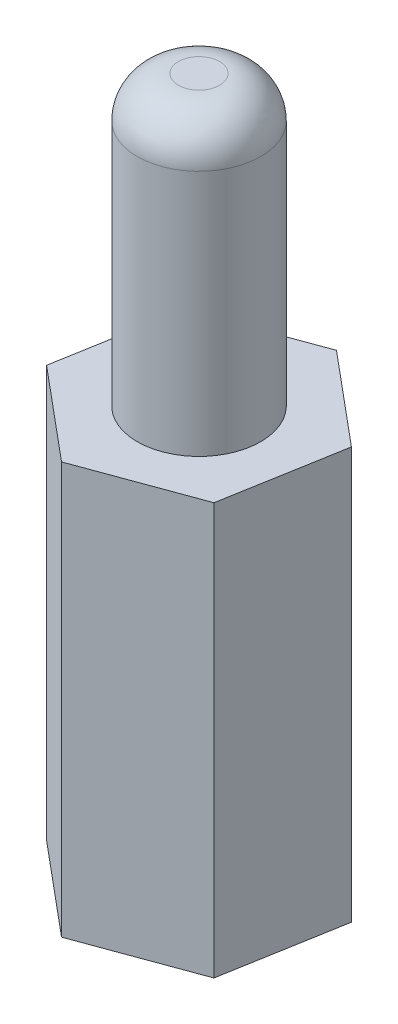
ISO-10303-21;
HEADER;
FILE_DESCRIPTION(('STEP AP214'),'2;1');
FILE_NAME('part.step','',(''),(''),'','','');
FILE_SCHEMA(('AUTOMOTIVE_DESIGN { 1 0 10303 214 1 1 1 1 }'));
ENDSEC;
DATA;
#1=APPLICATION_CONTEXT('core data for automotive mechanical design processes');
#2=APPLICATION_PROTOCOL_DEFINITION('international standard','automotive_design',2000,#1);
#3=PRODUCT_CONTEXT('',#1,'mechanical');
#4=PRODUCT('Part','Part','',(#3));
#5=PRODUCT_RELATED_PRODUCT_CATEGORY('part','',(#4));
#6=PRODUCT_DEFINITION_FORMATION('','',#4);
#7=PRODUCT_DEFINITION_CONTEXT('part definition',#1,'design');
#8=PRODUCT_DEFINITION('design','',#6,#7);
#9=PRODUCT_DEFINITION_SHAPE('','',#8);
#10=(LENGTH_UNIT() NAMED_UNIT(*) SI_UNIT(.MILLI.,.METRE.));
#11=(NAMED_UNIT(*) PLANE_ANGLE_UNIT() SI_UNIT($,.RADIAN.));
#12=(NAMED_UNIT(*) SI_UNIT($,.STERADIAN.) SOLID_ANGLE_UNIT());
#13=UNCERTAINTY_MEASURE_WITH_UNIT(LENGTH_MEASURE(1.E-05),#10,'distance_accuracy_value','');
#14=(GEOMETRIC_REPRESENTATION_CONTEXT(3) GLOBAL_UNCERTAINTY_ASSIGNED_CONTEXT((#13)) GLOBAL_UNIT_ASSIGNED_CONTEXT((#10,
#11,#12)) REPRESENTATION_CONTEXT('',''));
#15=CARTESIAN_POINT('',(0.,0.,0.));
#16=DIRECTION('',(0.,0.,1.));
#17=DIRECTION('',(1.,0.,0.));
#18=AXIS2_PLACEMENT_3D('',#15,#16,#17);
#19=CARTESIAN_POINT('',(-0.495994709202007,10.,2.84382182665809));
#20=DIRECTION('',(-0.343765976383913,0.,-0.939055351659749));
#21=DIRECTION('',(-0.939055351659749,0.,0.343765976383913));
#22=AXIS2_PLACEMENT_3D('',#19,#20,#21);
#23=PLANE('',#22);
#24=DIRECTION('',(0.939055351659749,0.,-0.343765976383913));
#25=VECTOR('',#24,1.);
#26=CARTESIAN_POINT('',(-0.495994709202007,0.,2.84382182665809));
#27=LINE('',#26,#25);
#28=CARTESIAN_POINT('',(-0.495994709202007,0.,2.84382182665809));
#29=VERTEX_POINT('',#28);
#30=CARTESIAN_POINT('',(2.21482459112157,0.,1.85145493164066));
#31=VERTEX_POINT('',#30);
#32=EDGE_CURVE('E134',#29,#31,#27,.T.);
#33=ORIENTED_EDGE('',*,*,#32,.T.);
#34=DIRECTION('',(0.,-1.,0.));
#35=VECTOR('',#34,1.);
#36=CARTESIAN_POINT('',(2.21482459112157,10.,1.85145493164066));
#37=LINE('',#36,#35);
#38=CARTESIAN_POINT('',(2.21482459112157,10.,1.85145493164066));
#39=VERTEX_POINT('',#38);
#40=EDGE_CURVE('E162',#39,#31,#37,.T.);
#41=ORIENTED_EDGE('',*,*,#40,.F.);
#42=DIRECTION('',(0.939055351659749,0.,-0.343765976383913));
#43=VECTOR('',#42,1.);
#44=CARTESIAN_POINT('',(-0.495994709202007,10.,2.84382182665809));
#45=LINE('',#44,#43);
#46=CARTESIAN_POINT('',(-0.495994709202007,10.,2.84382182665809));
#47=VERTEX_POINT('',#46);
#48=EDGE_CURVE('E151',#47,#39,#45,.T.);
#49=ORIENTED_EDGE('',*,*,#48,.F.);
#50=DIRECTION('',(0.,-1.,0.));
#51=VECTOR('',#50,1.);
#52=CARTESIAN_POINT('',(-0.495994709202007,10.,2.84382182665809));
#53=LINE('',#52,#51);
#54=EDGE_CURVE('E130',#47,#29,#53,.T.);
#55=ORIENTED_EDGE('',*,*,#54,.T.);
#56=EDGE_LOOP('',(#33,#41,#49,#55));
#57=FACE_BOUND('',#56,.T.);
#58=ADVANCED_FACE('F43',(#57),#23,.F.);
#59=CARTESIAN_POINT('',(2.21482459112157,10.,1.85145493164066));
#60=DIRECTION('',(-0.985128778289029,0.,-0.171817607324645));
#61=DIRECTION('',(-0.171817607324645,0.,0.985128778289029));
#62=AXIS2_PLACEMENT_3D('',#59,#60,#61);
#63=PLANE('',#62);
#64=DIRECTION('',(0.171817607324645,0.,-0.985128778289029));
#65=VECTOR('',#64,1.);
#66=CARTESIAN_POINT('',(2.21482459112157,0.,1.85145493164066));
#67=LINE('',#66,#65);
#68=CARTESIAN_POINT('',(2.71081930032357,0.,-0.992366895017432));
#69=VERTEX_POINT('',#68);
#70=EDGE_CURVE('E138',#31,#69,#67,.T.);
#71=ORIENTED_EDGE('',*,*,#70,.T.);
#72=DIRECTION('',(0.,-1.,0.));
#73=VECTOR('',#72,1.);
#74=CARTESIAN_POINT('',(2.71081930032357,10.,-0.992366895017432));
#75=LINE('',#74,#73);
#76=CARTESIAN_POINT('',(2.71081930032357,10.,-0.992366895017432));
#77=VERTEX_POINT('',#76);
#78=EDGE_CURVE('E158',#77,#69,#75,.T.);
#79=ORIENTED_EDGE('',*,*,#78,.F.);
#80=DIRECTION('',(0.171817607324645,0.,-0.985128778289029));
#81=VECTOR('',#80,1.);
#82=CARTESIAN_POINT('',(2.21482459112157,10.,1.85145493164066));
#83=LINE('',#82,#81);
#84=EDGE_CURVE('E99',#39,#77,#83,.T.);
#85=ORIENTED_EDGE('',*,*,#84,.F.);
#86=ORIENTED_EDGE('',*,*,#40,.T.);
#87=EDGE_LOOP('',(#71,#79,#85,#86));
#88=FACE_BOUND('',#87,.T.);
#89=ADVANCED_FACE('F211',(#88),#63,.F.);
#90=CARTESIAN_POINT('',(2.71081930032357,10.,-0.992366895017432));
#91=DIRECTION('',(-0.641362801905116,0.,0.767237744335104));
#92=DIRECTION('',(0.767237744335104,0.,0.641362801905116));
#93=AXIS2_PLACEMENT_3D('',#90,#91,#92);
#94=PLANE('',#93);
#95=DIRECTION('',(-0.767237744335104,0.,-0.641362801905116));
#96=VECTOR('',#95,1.);
#97=CARTESIAN_POINT('',(2.71081930032357,0.,-0.992366895017432));
#98=LINE('',#97,#96);
#99=CARTESIAN_POINT('',(0.495994709202006,0.,-2.84382182665809));
#100=VERTEX_POINT('',#99);
#101=EDGE_CURVE('E142',#69,#100,#98,.T.);
#102=ORIENTED_EDGE('',*,*,#101,.T.);
#103=DIRECTION('',(0.,-1.,0.));
#104=VECTOR('',#103,1.);
#105=CARTESIAN_POINT('',(0.495994709202006,10.,-2.84382182665809));
#106=LINE('',#105,#104);
#107=CARTESIAN_POINT('',(0.495994709202006,10.,-2.84382182665809));
#108=VERTEX_POINT('',#107);
#109=EDGE_CURVE('E123',#108,#100,#106,.T.);
#110=ORIENTED_EDGE('',*,*,#109,.F.);
#111=DIRECTION('',(-0.767237744335104,0.,-0.641362801905116));
#112=VECTOR('',#111,1.);
#113=CARTESIAN_POINT('',(2.71081930032357,10.,-0.992366895017432));
#114=LINE('',#113,#112);
#115=EDGE_CURVE('E112',#77,#108,#114,.T.);
#116=ORIENTED_EDGE('',*,*,#115,.F.);
#117=ORIENTED_EDGE('',*,*,#78,.T.);
#118=EDGE_LOOP('',(#102,#110,#116,#117));
#119=FACE_BOUND('',#118,.T.);
#120=ADVANCED_FACE('F215',(#119),#94,.F.);
#121=CARTESIAN_POINT('',(0.495994709202006,10.,-2.84382182665809));
#122=DIRECTION('',(0.343765976383912,0.,0.939055351659749));
#123=DIRECTION('',(0.939055351659749,0.,-0.343765976383912));
#124=AXIS2_PLACEMENT_3D('',#121,#122,#123);
#125=PLANE('',#124);
#126=DIRECTION('',(-0.939055351659749,0.,0.343765976383912));
#127=VECTOR('',#126,1.);
#128=CARTESIAN_POINT('',(0.495994709202006,0.,-2.84382182665809));
#129=LINE('',#128,#127);
#130=CARTESIAN_POINT('',(-2.21482459112157,0.,-1.85145493164066));
#131=VERTEX_POINT('',#130);
#132=EDGE_CURVE('E121',#100,#131,#129,.T.);
#133=ORIENTED_EDGE('',*,*,#132,.T.);
#134=DIRECTION('',(0.,-1.,0.));
#135=VECTOR('',#134,1.);
#136=CARTESIAN_POINT('',(-2.21482459112157,10.,-1.85145493164066));
#137=LINE('',#136,#135);
#138=CARTESIAN_POINT('',(-2.21482459112157,10.,-1.85145493164066));
#139=VERTEX_POINT('',#138);
#140=EDGE_CURVE('E118',#139,#131,#137,.T.);
#141=ORIENTED_EDGE('',*,*,#140,.F.);
#142=DIRECTION('',(-0.939055351659749,0.,0.343765976383912));
#143=VECTOR('',#142,1.);
#144=CARTESIAN_POINT('',(0.495994709202006,10.,-2.84382182665809));
#145=LINE('',#144,#143);
#146=EDGE_CURVE('E106',#108,#139,#145,.T.);
#147=ORIENTED_EDGE('',*,*,#146,.F.);
#148=ORIENTED_EDGE('',*,*,#109,.T.);
#149=EDGE_LOOP('',(#133,#141,#147,#148));
#150=FACE_BOUND('',#149,.T.);
#151=ADVANCED_FACE('F119',(#150),#125,.F.);
#152=CARTESIAN_POINT('',(-2.21482459112157,10.,-1.85145493164066));
#153=DIRECTION('',(0.985128778289029,0.,0.171817607324645));
#154=DIRECTION('',(0.171817607324645,0.,-0.985128778289029));
#155=AXIS2_PLACEMENT_3D('',#152,#153,#154);
#156=PLANE('',#155);
#157=DIRECTION('',(-0.171817607324645,0.,0.985128778289029));
#158=VECTOR('',#157,1.);
#159=CARTESIAN_POINT('',(-2.21482459112157,0.,-1.85145493164066));
#160=LINE('',#159,#158);
#161=CARTESIAN_POINT('',(-2.71081930032357,0.,0.992366895017432));
#162=VERTEX_POINT('',#161);
#163=EDGE_CURVE('E84',#131,#162,#160,.T.);
#164=ORIENTED_EDGE('',*,*,#163,.T.);
#165=DIRECTION('',(0.,-1.,0.));
#166=VECTOR('',#165,1.);
#167=CARTESIAN_POINT('',(-2.71081930032357,10.,0.992366895017432));
#168=LINE('',#167,#166);
#169=CARTESIAN_POINT('',(-2.71081930032357,10.,0.992366895017432));
#170=VERTEX_POINT('',#169);
#171=EDGE_CURVE('E124',#170,#162,#168,.T.);
#172=ORIENTED_EDGE('',*,*,#171,.F.);
#173=DIRECTION('',(-0.171817607324645,0.,0.985128778289029));
#174=VECTOR('',#173,1.);
#175=CARTESIAN_POINT('',(-2.21482459112157,10.,-1.85145493164066));
#176=LINE('',#175,#174);
#177=EDGE_CURVE('E110',#139,#170,#176,.T.);
#178=ORIENTED_EDGE('',*,*,#177,.F.);
#179=ORIENTED_EDGE('',*,*,#140,.T.);
#180=EDGE_LOOP('',(#164,#172,#178,#179));
#181=FACE_BOUND('',#180,.T.);
#182=ADVANCED_FACE('F126',(#181),#156,.F.);
#183=CARTESIAN_POINT('',(-2.71081930032357,10.,0.992366895017432));
#184=DIRECTION('',(0.641362801905116,0.,-0.767237744335104));
#185=DIRECTION('',(-0.767237744335104,0.,-0.641362801905116));
#186=AXIS2_PLACEMENT_3D('',#183,#184,#185);
#187=PLANE('',#186);
#188=DIRECTION('',(0.767237744335104,0.,0.641362801905116));
#189=VECTOR('',#188,1.);
#190=CARTESIAN_POINT('',(-2.71081930032357,0.,0.992366895017432));
#191=LINE('',#190,#189);
#192=EDGE_CURVE('E90',#162,#29,#191,.T.);
#193=ORIENTED_EDGE('',*,*,#192,.T.);
#194=ORIENTED_EDGE('',*,*,#54,.F.);
#195=DIRECTION('',(0.767237744335104,0.,0.641362801905116));
#196=VECTOR('',#195,1.);
#197=CARTESIAN_POINT('',(-2.71081930032357,10.,0.992366895017432));
#198=LINE('',#197,#196);
#199=EDGE_CURVE('E61',#170,#47,#198,.T.);
#200=ORIENTED_EDGE('',*,*,#199,.F.);
#201=ORIENTED_EDGE('',*,*,#171,.T.);
#202=EDGE_LOOP('',(#193,#194,#200,#201));
#203=FACE_BOUND('',#202,.T.);
#204=ADVANCED_FACE('F200',(#203),#187,.F.);
#205=CARTESIAN_POINT('',(0.,10.,0.));
#206=DIRECTION('',(0.,1.,0.));
#207=DIRECTION('',(0.,0.,1.));
#208=AXIS2_PLACEMENT_3D('',#205,#206,#207);
#209=PLANE('',#208);
#210=CARTESIAN_POINT('',(0.,10.,0.));
#211=DIRECTION('',(0.,1.,0.));
#212=DIRECTION('',(0.,0.,1.));
#213=AXIS2_PLACEMENT_3D('',#210,#211,#212);
#214=CIRCLE('',#213,1.5);
#215=CARTESIAN_POINT('',(0.,10.,1.5));
#216=VERTEX_POINT('',#215);
#217=EDGE_CURVE('E164',#216,#216,#214,.T.);
#218=ORIENTED_EDGE('',*,*,#217,.F.);
#219=EDGE_LOOP('',(#218));
#220=FACE_BOUND('',#219,.T.);
#221=ORIENTED_EDGE('',*,*,#48,.T.);
#222=ORIENTED_EDGE('',*,*,#84,.T.);
#223=ORIENTED_EDGE('',*,*,#115,.T.);
#224=ORIENTED_EDGE('',*,*,#146,.T.);
#225=ORIENTED_EDGE('',*,*,#177,.T.);
#226=ORIENTED_EDGE('',*,*,#199,.T.);
#227=EDGE_LOOP('',(#221,#222,#223,#224,#225,#226));
#228=FACE_BOUND('',#227,.T.);
#229=ADVANCED_FACE('F108',(#220,#228),#209,.T.);
#230=CARTESIAN_POINT('',(0.,0.,0.));
#231=DIRECTION('',(0.,1.,0.));
#232=DIRECTION('',(0.,0.,1.));
#233=AXIS2_PLACEMENT_3D('',#230,#231,#232);
#234=PLANE('',#233);
#235=CARTESIAN_POINT('',(0.,0.,0.));
#236=DIRECTION('',(0.,-1.,0.));
#237=DIRECTION('',(0.,0.,-1.));
#238=AXIS2_PLACEMENT_3D('',#235,#236,#237);
#239=CIRCLE('',#238,1.5);
#240=CARTESIAN_POINT('',(0.,0.,-1.5));
#241=VERTEX_POINT('',#240);
#242=EDGE_CURVE('E176',#241,#241,#239,.T.);
#243=ORIENTED_EDGE('',*,*,#242,.F.);
#244=EDGE_LOOP('',(#243));
#245=FACE_BOUND('',#244,.T.);
#246=ORIENTED_EDGE('',*,*,#32,.F.);
#247=ORIENTED_EDGE('',*,*,#192,.F.);
#248=ORIENTED_EDGE('',*,*,#163,.F.);
#249=ORIENTED_EDGE('',*,*,#132,.F.);
#250=ORIENTED_EDGE('',*,*,#101,.F.);
#251=ORIENTED_EDGE('',*,*,#70,.F.);
#252=EDGE_LOOP('',(#246,#247,#248,#249,#250,#251));
#253=FACE_BOUND('',#252,.T.);
#254=ADVANCED_FACE('F190',(#245,#253),#234,.F.);
#255=CARTESIAN_POINT('',(0.,17.,0.));
#256=DIRECTION('',(0.,-1.,0.));
#257=DIRECTION('',(0.,0.,-1.));
#258=AXIS2_PLACEMENT_3D('',#255,#256,#257);
#259=CYLINDRICAL_SURFACE('',#258,1.5);
#260=CARTESIAN_POINT('',(0.,16.,0.));
#261=DIRECTION('',(0.,1.,0.));
#262=DIRECTION('',(0.,0.,1.));
#263=AXIS2_PLACEMENT_3D('',#260,#261,#262);
#264=CIRCLE('',#263,1.5);
#265=CARTESIAN_POINT('',(0.,16.,1.5));
#266=VERTEX_POINT('',#265);
#267=EDGE_CURVE('E11',#266,#266,#264,.F.);
#268=ORIENTED_EDGE('',*,*,#267,.T.);
#269=EDGE_LOOP('',(#268));
#270=FACE_BOUND('',#269,.T.);
#271=ORIENTED_EDGE('',*,*,#217,.T.);
#272=EDGE_LOOP('',(#271));
#273=FACE_BOUND('',#272,.T.);
#274=ADVANCED_FACE('F193',(#270,#273),#259,.T.);
#275=CARTESIAN_POINT('',(0.,17.,0.));
#276=DIRECTION('',(0.,1.,0.));
#277=DIRECTION('',(0.,0.,1.));
#278=AXIS2_PLACEMENT_3D('',#275,#276,#277);
#279=PLANE('',#278);
#280=CARTESIAN_POINT('',(0.,17.,0.));
#281=DIRECTION('',(0.,1.,0.));
#282=DIRECTION('',(0.,0.,1.));
#283=AXIS2_PLACEMENT_3D('',#280,#281,#282);
#284=CIRCLE('',#283,0.5);
#285=CARTESIAN_POINT('',(0.,17.,0.5));
#286=VERTEX_POINT('',#285);
#287=EDGE_CURVE('E53',#286,#286,#284,.T.);
#288=ORIENTED_EDGE('',*,*,#287,.T.);
#289=EDGE_LOOP('',(#288));
#290=FACE_BOUND('',#289,.T.);
#291=ADVANCED_FACE('F262',(#290),#279,.T.);
#292=CARTESIAN_POINT('',(0.,7.,0.));
#293=DIRECTION('',(0.,-1.,0.));
#294=DIRECTION('',(0.,0.,-1.));
#295=AXIS2_PLACEMENT_3D('',#292,#293,#294);
#296=CYLINDRICAL_SURFACE('',#295,1.5);
#297=CARTESIAN_POINT('',(0.,7.,0.));
#298=DIRECTION('',(0.,-1.,0.));
#299=DIRECTION('',(0.,0.,-1.));
#300=AXIS2_PLACEMENT_3D('',#297,#298,#299);
#301=CIRCLE('',#300,1.5);
#302=CARTESIAN_POINT('',(0.,7.,-1.5));
#303=VERTEX_POINT('',#302);
#304=EDGE_CURVE('E139',#303,#303,#301,.T.);
#305=ORIENTED_EDGE('',*,*,#304,.F.);
#306=EDGE_LOOP('',(#305));
#307=FACE_BOUND('',#306,.T.);
#308=ORIENTED_EDGE('',*,*,#242,.T.);
#309=EDGE_LOOP('',(#308));
#310=FACE_BOUND('',#309,.T.);
#311=ADVANCED_FACE('F188',(#307,#310),#296,.F.);
#312=CARTESIAN_POINT('',(0.,7.,0.));
#313=DIRECTION('',(0.,-1.,0.));
#314=DIRECTION('',(0.,0.,-1.));
#315=AXIS2_PLACEMENT_3D('',#312,#313,#314);
#316=PLANE('',#315);
#317=ORIENTED_EDGE('',*,*,#304,.T.);
#318=EDGE_LOOP('',(#317));
#319=FACE_BOUND('',#318,.T.);
#320=ADVANCED_FACE('F261',(#319),#316,.T.);
#321=CARTESIAN_POINT('',(0.,16.,0.));
#322=DIRECTION('',(0.,1.,0.));
#323=DIRECTION('',(0.,0.,1.));
#324=AXIS2_PLACEMENT_3D('',#321,#322,#323);
#325=DEGENERATE_TOROIDAL_SURFACE('',#324,0.5,1.,.T.);
#326=ORIENTED_EDGE('',*,*,#267,.F.);
#327=EDGE_LOOP('',(#326));
#328=FACE_BOUND('',#327,.T.);
#329=ORIENTED_EDGE('',*,*,#287,.F.);
#330=EDGE_LOOP('',(#329));
#331=FACE_BOUND('',#330,.T.);
#332=ADVANCED_FACE('F45',(#328,#331),#325,.T.);
#333=CLOSED_SHELL('',(#58,#89,#120,#151,#182,#204,#229,#254,#274,#291,#311,#320,#332));
#334=MANIFOLD_SOLID_BREP('B2',#333);
#335=ADVANCED_BREP_SHAPE_REPRESENTATION('',(#18,#334),#14);
#336=SHAPE_DEFINITION_REPRESENTATION(#9,#335);
ENDSEC;
END-ISO-10303-21;
